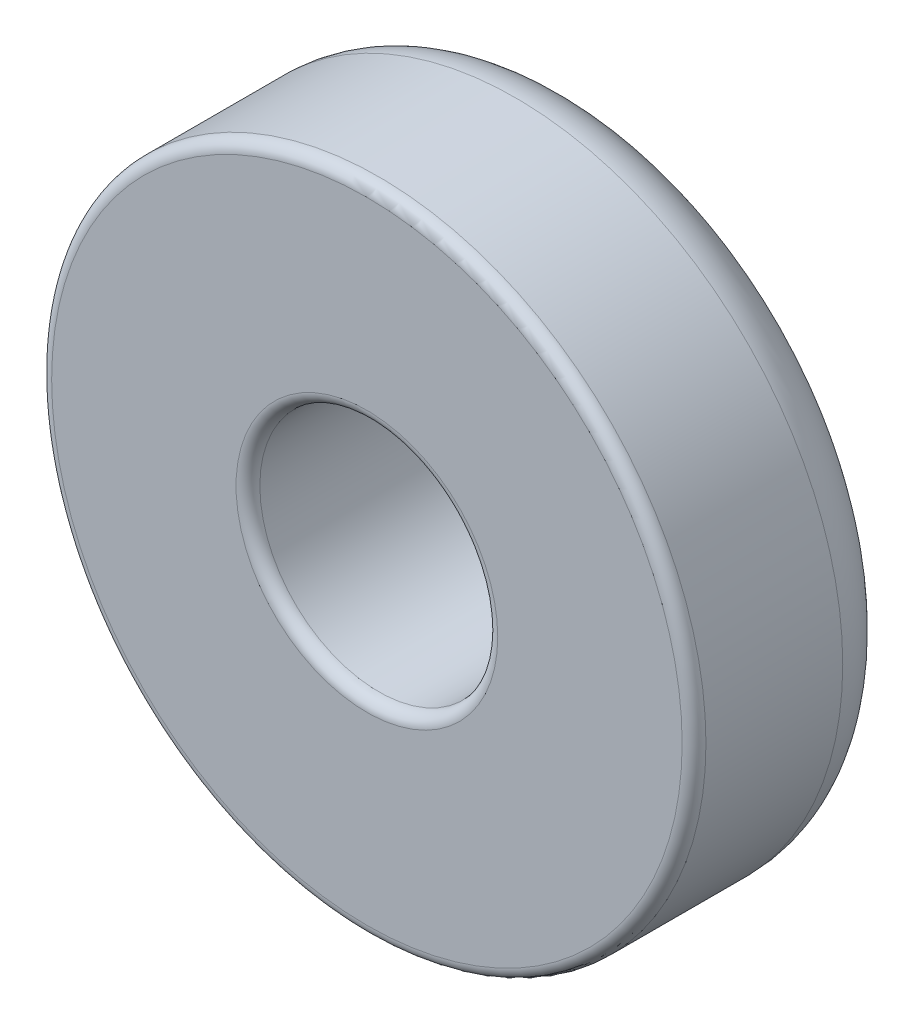
ISO-10303-21;
HEADER;
FILE_DESCRIPTION(('STEP AP214'),'2;1');
FILE_NAME('part.step','',(''),(''),'','','');
FILE_SCHEMA(('AUTOMOTIVE_DESIGN { 1 0 10303 214 1 1 1 1 }'));
ENDSEC;
DATA;
#1=APPLICATION_CONTEXT('core data for automotive mechanical design processes');
#2=APPLICATION_PROTOCOL_DEFINITION('international standard','automotive_design',2000,#1);
#3=PRODUCT_CONTEXT('',#1,'mechanical');
#4=PRODUCT('Part','Part','',(#3));
#5=PRODUCT_RELATED_PRODUCT_CATEGORY('part','',(#4));
#6=PRODUCT_DEFINITION_FORMATION('','',#4);
#7=PRODUCT_DEFINITION_CONTEXT('part definition',#1,'design');
#8=PRODUCT_DEFINITION('design','',#6,#7);
#9=PRODUCT_DEFINITION_SHAPE('','',#8);
#10=(LENGTH_UNIT() NAMED_UNIT(*) SI_UNIT(.MILLI.,.METRE.));
#11=(NAMED_UNIT(*) PLANE_ANGLE_UNIT() SI_UNIT($,.RADIAN.));
#12=(NAMED_UNIT(*) SI_UNIT($,.STERADIAN.) SOLID_ANGLE_UNIT());
#13=UNCERTAINTY_MEASURE_WITH_UNIT(LENGTH_MEASURE(1.E-05),#10,'distance_accuracy_value','');
#14=(GEOMETRIC_REPRESENTATION_CONTEXT(3) GLOBAL_UNCERTAINTY_ASSIGNED_CONTEXT((#13)) GLOBAL_UNIT_ASSIGNED_CONTEXT((#10,
#11,#12)) REPRESENTATION_CONTEXT('',''));
#15=CARTESIAN_POINT('',(0.,0.,0.));
#16=DIRECTION('',(0.,0.,1.));
#17=DIRECTION('',(1.,0.,0.));
#18=AXIS2_PLACEMENT_3D('',#15,#16,#17);
#19=CARTESIAN_POINT('',(0.,0.,9.45953923614254));
#20=DIRECTION('',(0.,0.,1.));
#21=DIRECTION('',(1.,0.,0.));
#22=AXIS2_PLACEMENT_3D('',#19,#20,#21);
#23=PLANE('',#22);
#24=CARTESIAN_POINT('',(0.,0.,9.45953923614254));
#25=DIRECTION('',(0.,0.,1.));
#26=DIRECTION('',(1.,0.,0.));
#27=AXIS2_PLACEMENT_3D('',#24,#25,#26);
#28=CIRCLE('',#27,11.);
#29=CARTESIAN_POINT('',(11.,0.,9.45953923614254));
#30=VERTEX_POINT('',#29);
#31=EDGE_CURVE('E51',#30,#30,#28,.F.);
#32=ORIENTED_EDGE('',*,*,#31,.T.);
#33=EDGE_LOOP('',(#32));
#34=FACE_BOUND('',#33,.T.);
#35=CARTESIAN_POINT('',(0.,0.,9.45953923614254));
#36=DIRECTION('',(0.,0.,1.));
#37=DIRECTION('',(1.,0.,0.));
#38=AXIS2_PLACEMENT_3D('',#35,#36,#37);
#39=CIRCLE('',#38,26.5);
#40=CARTESIAN_POINT('',(26.5,0.,9.45953923614254));
#41=VERTEX_POINT('',#40);
#42=EDGE_CURVE('E55',#41,#41,#39,.T.);
#43=ORIENTED_EDGE('',*,*,#42,.T.);
#44=EDGE_LOOP('',(#43));
#45=FACE_BOUND('',#44,.T.);
#46=ADVANCED_FACE('F44',(#34,#45),#23,.T.);
#47=CARTESIAN_POINT('',(0.,0.,-8.04046076385746));
#48=DIRECTION('',(0.,0.,1.));
#49=DIRECTION('',(1.,0.,0.));
#50=AXIS2_PLACEMENT_3D('',#47,#48,#49);
#51=PLANE('',#50);
#52=CARTESIAN_POINT('',(0.,0.,-8.04046076385746));
#53=DIRECTION('',(0.,0.,1.));
#54=DIRECTION('',(1.,0.,0.));
#55=AXIS2_PLACEMENT_3D('',#52,#53,#54);
#56=CIRCLE('',#55,11.);
#57=CARTESIAN_POINT('',(11.,0.,-8.04046076385746));
#58=VERTEX_POINT('',#57);
#59=EDGE_CURVE('E67',#58,#58,#56,.T.);
#60=ORIENTED_EDGE('',*,*,#59,.T.);
#61=EDGE_LOOP('',(#60));
#62=FACE_BOUND('',#61,.T.);
#63=CARTESIAN_POINT('',(0.,0.,-8.04046076385746));
#64=DIRECTION('',(0.,0.,1.));
#65=DIRECTION('',(1.,0.,0.));
#66=AXIS2_PLACEMENT_3D('',#63,#64,#65);
#67=CIRCLE('',#66,22.5);
#68=CARTESIAN_POINT('',(22.5,0.,-8.04046076385746));
#69=VERTEX_POINT('',#68);
#70=EDGE_CURVE('E70',#69,#69,#67,.F.);
#71=ORIENTED_EDGE('',*,*,#70,.T.);
#72=EDGE_LOOP('',(#71));
#73=FACE_BOUND('',#72,.T.);
#74=ADVANCED_FACE('F97',(#62,#73),#51,.F.);
#75=CARTESIAN_POINT('',(0.,0.,9.45953923614254));
#76=DIRECTION('',(0.,0.,-1.));
#77=DIRECTION('',(-1.,0.,0.));
#78=AXIS2_PLACEMENT_3D('',#75,#76,#77);
#79=CYLINDRICAL_SURFACE('',#78,27.5);
#80=CARTESIAN_POINT('',(0.,0.,8.45953923614254));
#81=DIRECTION('',(0.,0.,1.));
#82=DIRECTION('',(1.,0.,0.));
#83=AXIS2_PLACEMENT_3D('',#80,#81,#82);
#84=CIRCLE('',#83,27.5);
#85=CARTESIAN_POINT('',(27.5,0.,8.45953923614254));
#86=VERTEX_POINT('',#85);
#87=EDGE_CURVE('E11',#86,#86,#84,.F.);
#88=ORIENTED_EDGE('',*,*,#87,.T.);
#89=EDGE_LOOP('',(#88));
#90=FACE_BOUND('',#89,.T.);
#91=CARTESIAN_POINT('',(0.,0.,-3.04046076385746));
#92=DIRECTION('',(0.,0.,1.));
#93=DIRECTION('',(1.,0.,0.));
#94=AXIS2_PLACEMENT_3D('',#91,#92,#93);
#95=CIRCLE('',#94,27.5);
#96=CARTESIAN_POINT('',(27.5,0.,-3.04046076385746));
#97=VERTEX_POINT('',#96);
#98=EDGE_CURVE('E73',#97,#97,#95,.T.);
#99=ORIENTED_EDGE('',*,*,#98,.T.);
#100=EDGE_LOOP('',(#99));
#101=FACE_BOUND('',#100,.T.);
#102=ADVANCED_FACE('F77',(#90,#101),#79,.T.);
#103=CARTESIAN_POINT('',(0.,0.,9.45953923614254));
#104=DIRECTION('',(0.,0.,-1.));
#105=DIRECTION('',(-1.,0.,0.));
#106=AXIS2_PLACEMENT_3D('',#103,#104,#105);
#107=CYLINDRICAL_SURFACE('',#106,10.);
#108=CARTESIAN_POINT('',(0.,0.,-7.04046076385746));
#109=DIRECTION('',(0.,0.,1.));
#110=DIRECTION('',(1.,0.,0.));
#111=AXIS2_PLACEMENT_3D('',#108,#109,#110);
#112=CIRCLE('',#111,10.);
#113=CARTESIAN_POINT('',(10.,0.,-7.04046076385746));
#114=VERTEX_POINT('',#113);
#115=EDGE_CURVE('E59',#114,#114,#112,.F.);
#116=ORIENTED_EDGE('',*,*,#115,.T.);
#117=EDGE_LOOP('',(#116));
#118=FACE_BOUND('',#117,.T.);
#119=CARTESIAN_POINT('',(0.,0.,8.45953923614254));
#120=DIRECTION('',(0.,0.,1.));
#121=DIRECTION('',(1.,0.,0.));
#122=AXIS2_PLACEMENT_3D('',#119,#120,#121);
#123=CIRCLE('',#122,10.);
#124=CARTESIAN_POINT('',(10.,0.,8.45953923614254));
#125=VERTEX_POINT('',#124);
#126=EDGE_CURVE('E64',#125,#125,#123,.T.);
#127=ORIENTED_EDGE('',*,*,#126,.T.);
#128=EDGE_LOOP('',(#127));
#129=FACE_BOUND('',#128,.T.);
#130=ADVANCED_FACE('F82',(#118,#129),#107,.F.);
#131=CARTESIAN_POINT('',(0.,0.,-3.04046076385746));
#132=DIRECTION('',(0.,0.,1.));
#133=DIRECTION('',(1.,0.,0.));
#134=AXIS2_PLACEMENT_3D('',#131,#132,#133);
#135=TOROIDAL_SURFACE('',#134,22.5,5.);
#136=ORIENTED_EDGE('',*,*,#70,.F.);
#137=EDGE_LOOP('',(#136));
#138=FACE_BOUND('',#137,.T.);
#139=ORIENTED_EDGE('',*,*,#98,.F.);
#140=EDGE_LOOP('',(#139));
#141=FACE_BOUND('',#140,.T.);
#142=ADVANCED_FACE('F79',(#138,#141),#135,.T.);
#143=CARTESIAN_POINT('',(0.,0.,-7.04046076385746));
#144=DIRECTION('',(0.,0.,1.));
#145=DIRECTION('',(1.,0.,0.));
#146=AXIS2_PLACEMENT_3D('',#143,#144,#145);
#147=TOROIDAL_SURFACE('',#146,11.,1.);
#148=ORIENTED_EDGE('',*,*,#115,.F.);
#149=EDGE_LOOP('',(#148));
#150=FACE_BOUND('',#149,.T.);
#151=ORIENTED_EDGE('',*,*,#59,.F.);
#152=EDGE_LOOP('',(#151));
#153=FACE_BOUND('',#152,.T.);
#154=ADVANCED_FACE('F81',(#150,#153),#147,.T.);
#155=CARTESIAN_POINT('',(0.,0.,8.45953923614254));
#156=DIRECTION('',(0.,0.,1.));
#157=DIRECTION('',(1.,0.,0.));
#158=AXIS2_PLACEMENT_3D('',#155,#156,#157);
#159=TOROIDAL_SURFACE('',#158,11.,1.);
#160=ORIENTED_EDGE('',*,*,#31,.F.);
#161=EDGE_LOOP('',(#160));
#162=FACE_BOUND('',#161,.T.);
#163=ORIENTED_EDGE('',*,*,#126,.F.);
#164=EDGE_LOOP('',(#163));
#165=FACE_BOUND('',#164,.T.);
#166=ADVANCED_FACE('F89',(#162,#165),#159,.T.);
#167=CARTESIAN_POINT('',(0.,0.,8.45953923614254));
#168=DIRECTION('',(0.,0.,1.));
#169=DIRECTION('',(1.,0.,0.));
#170=AXIS2_PLACEMENT_3D('',#167,#168,#169);
#171=TOROIDAL_SURFACE('',#170,26.5,1.);
#172=ORIENTED_EDGE('',*,*,#87,.F.);
#173=EDGE_LOOP('',(#172));
#174=FACE_BOUND('',#173,.T.);
#175=ORIENTED_EDGE('',*,*,#42,.F.);
#176=EDGE_LOOP('',(#175));
#177=FACE_BOUND('',#176,.T.);
#178=ADVANCED_FACE('F46',(#174,#177),#171,.T.);
#179=CLOSED_SHELL('',(#46,#74,#102,#130,#142,#154,#166,#178));
#180=MANIFOLD_SOLID_BREP('B2',#179);
#181=ADVANCED_BREP_SHAPE_REPRESENTATION('',(#18,#180),#14);
#182=SHAPE_DEFINITION_REPRESENTATION(#9,#181);
ENDSEC;
END-ISO-10303-21;
